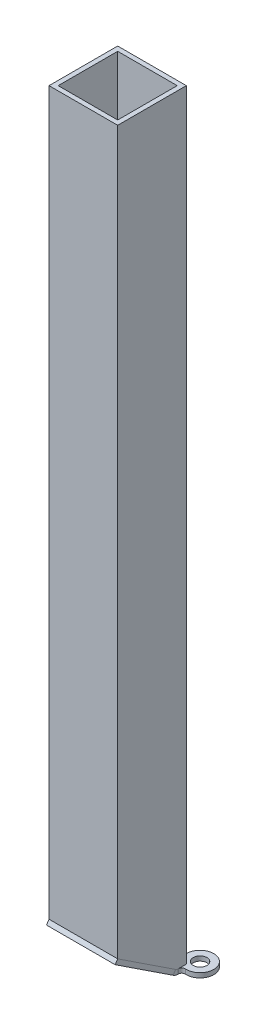
ISO-10303-21;
HEADER;
FILE_DESCRIPTION(('STEP AP214'),'2;1');
FILE_NAME('part.step','',(''),(''),'','','');
FILE_SCHEMA(('AUTOMOTIVE_DESIGN { 1 0 10303 214 1 1 1 1 }'));
ENDSEC;
DATA;
#1=APPLICATION_CONTEXT('core data for automotive mechanical design processes');
#2=APPLICATION_PROTOCOL_DEFINITION('international standard','automotive_design',2000,#1);
#3=PRODUCT_CONTEXT('',#1,'mechanical');
#4=PRODUCT('Part','Part','',(#3));
#5=PRODUCT_RELATED_PRODUCT_CATEGORY('part','',(#4));
#6=PRODUCT_DEFINITION_FORMATION('','',#4);
#7=PRODUCT_DEFINITION_CONTEXT('part definition',#1,'design');
#8=PRODUCT_DEFINITION('design','',#6,#7);
#9=PRODUCT_DEFINITION_SHAPE('','',#8);
#10=(LENGTH_UNIT() NAMED_UNIT(*) SI_UNIT(.MILLI.,.METRE.));
#11=(NAMED_UNIT(*) PLANE_ANGLE_UNIT() SI_UNIT($,.RADIAN.));
#12=(NAMED_UNIT(*) SI_UNIT($,.STERADIAN.) SOLID_ANGLE_UNIT());
#13=UNCERTAINTY_MEASURE_WITH_UNIT(LENGTH_MEASURE(1.E-05),#10,'distance_accuracy_value','');
#14=(GEOMETRIC_REPRESENTATION_CONTEXT(3) GLOBAL_UNCERTAINTY_ASSIGNED_CONTEXT((#13)) GLOBAL_UNIT_ASSIGNED_CONTEXT((#10,
#11,#12)) REPRESENTATION_CONTEXT('',''));
#15=CARTESIAN_POINT('',(0.,0.,0.));
#16=DIRECTION('',(0.,0.,1.));
#17=DIRECTION('',(1.,0.,0.));
#18=AXIS2_PLACEMENT_3D('',#15,#16,#17);
#19=CARTESIAN_POINT('',(1005.,-334.43981096134,-434.283231707318));
#20=DIRECTION('',(0.,0.,-1.));
#21=DIRECTION('',(1.,0.,0.));
#22=AXIS2_PLACEMENT_3D('',#19,#20,#21);
#23=PLANE('',#22);
#24=DIRECTION('',(1.,0.,0.));
#25=VECTOR('',#24,1.);
#26=CARTESIAN_POINT('',(1005.,-332.43981096134,-434.283231707318));
#27=LINE('',#26,#25);
#28=CARTESIAN_POINT('',(1011.5,-332.43981096134,-434.283231707318));
#29=VERTEX_POINT('',#28);
#30=CARTESIAN_POINT('',(1028.5,-332.43981096134,-434.283231707318));
#31=VERTEX_POINT('',#30);
#32=EDGE_CURVE('E133',#29,#31,#27,.T.);
#33=ORIENTED_EDGE('',*,*,#32,.T.);
#34=DIRECTION('',(0.,-1.,0.));
#35=VECTOR('',#34,1.);
#36=CARTESIAN_POINT('',(1028.5,-332.43981096134,-434.283231707318));
#37=LINE('',#36,#35);
#38=CARTESIAN_POINT('',(1028.5,-334.43981096134,-434.283231707318));
#39=VERTEX_POINT('',#38);
#40=EDGE_CURVE('E247',#31,#39,#37,.T.);
#41=ORIENTED_EDGE('',*,*,#40,.T.);
#42=DIRECTION('',(1.,0.,0.));
#43=VECTOR('',#42,1.);
#44=CARTESIAN_POINT('',(1005.,-334.43981096134,-434.283231707318));
#45=LINE('',#44,#43);
#46=CARTESIAN_POINT('',(1011.5,-334.43981096134,-434.283231707318));
#47=VERTEX_POINT('',#46);
#48=EDGE_CURVE('E168',#47,#39,#45,.T.);
#49=ORIENTED_EDGE('',*,*,#48,.F.);
#50=DIRECTION('',(0.,-1.,0.));
#51=VECTOR('',#50,1.);
#52=CARTESIAN_POINT('',(1011.5,-332.43981096134,-434.283231707318));
#53=LINE('',#52,#51);
#54=EDGE_CURVE('E208',#29,#47,#53,.T.);
#55=ORIENTED_EDGE('',*,*,#54,.F.);
#56=EDGE_LOOP('',(#33,#41,#49,#55));
#57=FACE_BOUND('',#56,.T.);
#58=ADVANCED_FACE('F51',(#57),#23,.T.);
#59=CARTESIAN_POINT('',(1035.,-334.43981096134,-430.113764924496));
#60=DIRECTION('',(-1.,0.,0.));
#61=DIRECTION('',(0.,0.,-1.));
#62=AXIS2_PLACEMENT_3D('',#59,#60,#61);
#63=PLANE('',#62);
#64=DIRECTION('',(0.,0.,-1.));
#65=VECTOR('',#64,1.);
#66=CARTESIAN_POINT('',(1035.,-332.43981096134,-430.113764924496));
#67=LINE('',#66,#65);
#68=CARTESIAN_POINT('',(1035.,-332.43981096134,-430.712849211409));
#69=VERTEX_POINT('',#68);
#70=CARTESIAN_POINT('',(1035.,-332.43981096134,-430.79991693377));
#71=VERTEX_POINT('',#70);
#72=EDGE_CURVE('E101',#69,#71,#67,.T.);
#73=ORIENTED_EDGE('',*,*,#72,.F.);
#74=DIRECTION('',(0.,-1.,0.));
#75=VECTOR('',#74,1.);
#76=CARTESIAN_POINT('',(1035.,-334.43981096134,-430.712849211409));
#77=LINE('',#76,#75);
#78=CARTESIAN_POINT('',(1035.,-334.43981096134,-430.712849211409));
#79=VERTEX_POINT('',#78);
#80=EDGE_CURVE('E12',#69,#79,#77,.T.);
#81=ORIENTED_EDGE('',*,*,#80,.T.);
#82=DIRECTION('',(0.,0.,-1.));
#83=VECTOR('',#82,1.);
#84=CARTESIAN_POINT('',(1035.,-334.43981096134,-430.113764924496));
#85=LINE('',#84,#83);
#86=CARTESIAN_POINT('',(1035.,-334.43981096134,-430.79991693377));
#87=VERTEX_POINT('',#86);
#88=EDGE_CURVE('E174',#79,#87,#85,.T.);
#89=ORIENTED_EDGE('',*,*,#88,.T.);
#90=DIRECTION('',(0.,-1.,0.));
#91=VECTOR('',#90,1.);
#92=CARTESIAN_POINT('',(1035.,-332.43981096134,-430.79991693377));
#93=LINE('',#92,#91);
#94=EDGE_CURVE('E132',#71,#87,#93,.T.);
#95=ORIENTED_EDGE('',*,*,#94,.F.);
#96=EDGE_LOOP('',(#73,#81,#89,#95));
#97=FACE_BOUND('',#96,.T.);
#98=ADVANCED_FACE('F130',(#97),#63,.F.);
#99=CARTESIAN_POINT('',(1005.,-334.43981096134,-430.113764924496));
#100=DIRECTION('',(-1.,0.,0.));
#101=DIRECTION('',(0.,0.,-1.));
#102=AXIS2_PLACEMENT_3D('',#99,#100,#101);
#103=PLANE('',#102);
#104=DIRECTION('',(0.,-1.,0.));
#105=VECTOR('',#104,1.);
#106=CARTESIAN_POINT('',(1005.,-332.43981096134,-430.79991693377));
#107=LINE('',#106,#105);
#108=CARTESIAN_POINT('',(1005.,-332.43981096134,-430.79991693377));
#109=VERTEX_POINT('',#108);
#110=CARTESIAN_POINT('',(1005.,-334.43981096134,-430.79991693377));
#111=VERTEX_POINT('',#110);
#112=EDGE_CURVE('E164',#109,#111,#107,.T.);
#113=ORIENTED_EDGE('',*,*,#112,.T.);
#114=DIRECTION('',(0.,0.,-1.));
#115=VECTOR('',#114,1.);
#116=CARTESIAN_POINT('',(1005.,-334.43981096134,-430.113764924496));
#117=LINE('',#116,#115);
#118=CARTESIAN_POINT('',(1005.,-334.43981096134,-430.712849211409));
#119=VERTEX_POINT('',#118);
#120=EDGE_CURVE('E160',#119,#111,#117,.T.);
#121=ORIENTED_EDGE('',*,*,#120,.F.);
#122=DIRECTION('',(0.,-1.,0.));
#123=VECTOR('',#122,1.);
#124=CARTESIAN_POINT('',(1005.,-334.43981096134,-430.712849211409));
#125=LINE('',#124,#123);
#126=CARTESIAN_POINT('',(1005.,-332.43981096134,-430.712849211409));
#127=VERTEX_POINT('',#126);
#128=EDGE_CURVE('E61',#127,#119,#125,.T.);
#129=ORIENTED_EDGE('',*,*,#128,.F.);
#130=DIRECTION('',(0.,0.,-1.));
#131=VECTOR('',#130,1.);
#132=CARTESIAN_POINT('',(1005.,-332.43981096134,-430.113764924496));
#133=LINE('',#132,#131);
#134=EDGE_CURVE('E104',#127,#109,#133,.T.);
#135=ORIENTED_EDGE('',*,*,#134,.T.);
#136=EDGE_LOOP('',(#113,#121,#129,#135));
#137=FACE_BOUND('',#136,.T.);
#138=ADVANCED_FACE('F161',(#137),#103,.T.);
#139=CARTESIAN_POINT('',(1005.,-330.43981096134,-430.712849211409));
#140=DIRECTION('',(1.,0.,0.));
#141=DIRECTION('',(0.,0.,1.));
#142=AXIS2_PLACEMENT_3D('',#139,#140,#141);
#143=PLANE('',#142);
#144=ORIENTED_EDGE('',*,*,#128,.T.);
#145=CARTESIAN_POINT('',(1005.,-330.43981096134,-430.712849211409));
#146=DIRECTION('',(1.,0.,0.));
#147=DIRECTION('',(0.,0.,-1.));
#148=AXIS2_PLACEMENT_3D('',#145,#146,#147);
#149=CIRCLE('',#148,4.);
#150=CARTESIAN_POINT('',(1005.,-333.781109326405,-428.513820963384));
#151=VERTEX_POINT('',#150);
#152=EDGE_CURVE('E155',#119,#151,#149,.F.);
#153=ORIENTED_EDGE('',*,*,#152,.T.);
#154=DIRECTION('',(0.,-0.835324591266377,0.549757062006174));
#155=VECTOR('',#154,1.);
#156=CARTESIAN_POINT('',(1005.,-333.781109326405,-428.513820963384));
#157=LINE('',#156,#155);
#158=CARTESIAN_POINT('',(1005.,-332.110460143872,-429.613335087396));
#159=VERTEX_POINT('',#158);
#160=EDGE_CURVE('E146',#159,#151,#157,.T.);
#161=ORIENTED_EDGE('',*,*,#160,.F.);
#162=CARTESIAN_POINT('',(1005.,-330.43981096134,-430.712849211409));
#163=DIRECTION('',(-1.,0.,0.));
#164=DIRECTION('',(0.,0.,1.));
#165=AXIS2_PLACEMENT_3D('',#162,#163,#164);
#166=CIRCLE('',#165,2.);
#167=EDGE_CURVE('E120',#127,#159,#166,.T.);
#168=ORIENTED_EDGE('',*,*,#167,.F.);
#169=EDGE_LOOP('',(#144,#153,#161,#168));
#170=FACE_BOUND('',#169,.T.);
#171=ADVANCED_FACE('F153',(#170),#143,.F.);
#172=CARTESIAN_POINT('',(1005.,-334.110460143872,-429.014250800484));
#173=DIRECTION('',(-1.,0.,0.));
#174=DIRECTION('',(0.,-0.549757062006174,-0.835324591266377));
#175=AXIS2_PLACEMENT_3D('',#172,#173,#174);
#176=PLANE('',#175);
#177=ORIENTED_EDGE('',*,*,#160,.T.);
#178=DIRECTION('',(0.,-0.549757062006174,-0.835324591266377));
#179=VECTOR('',#178,1.);
#180=CARTESIAN_POINT('',(1005.,-334.110460143872,-429.014250800484));
#181=LINE('',#180,#179);
#182=CARTESIAN_POINT('',(1005.,-317.110460143872,-403.183717583306));
#183=VERTEX_POINT('',#182);
#184=EDGE_CURVE('E171',#183,#151,#181,.T.);
#185=ORIENTED_EDGE('',*,*,#184,.F.);
#186=DIRECTION('',(0.,-0.835324591266377,0.549757062006174));
#187=VECTOR('',#186,1.);
#188=CARTESIAN_POINT('',(1005.,-317.110460143872,-403.183717583306));
#189=LINE('',#188,#187);
#190=CARTESIAN_POINT('',(1005.,-315.43981096134,-404.283231707318));
#191=VERTEX_POINT('',#190);
#192=EDGE_CURVE('E143',#191,#183,#189,.T.);
#193=ORIENTED_EDGE('',*,*,#192,.F.);
#194=DIRECTION('',(0.,-0.549757062006174,-0.835324591266377));
#195=VECTOR('',#194,1.);
#196=CARTESIAN_POINT('',(1005.,-332.43981096134,-430.113764924496));
#197=LINE('',#196,#195);
#198=EDGE_CURVE('E191',#191,#159,#197,.T.);
#199=ORIENTED_EDGE('',*,*,#198,.T.);
#200=EDGE_LOOP('',(#177,#185,#193,#199));
#201=FACE_BOUND('',#200,.T.);
#202=ADVANCED_FACE('F345',(#201),#176,.T.);
#203=CARTESIAN_POINT('',(1005.,-317.110460143872,-403.183717583306));
#204=DIRECTION('',(0.,-0.549757062006174,-0.835324591266377));
#205=DIRECTION('',(1.,0.,0.));
#206=AXIS2_PLACEMENT_3D('',#203,#204,#205);
#207=PLANE('',#206);
#208=ORIENTED_EDGE('',*,*,#192,.T.);
#209=DIRECTION('',(1.,0.,0.));
#210=VECTOR('',#209,1.);
#211=CARTESIAN_POINT('',(1005.,-317.110460143872,-403.183717583306));
#212=LINE('',#211,#210);
#213=CARTESIAN_POINT('',(1035.,-317.110460143872,-403.183717583306));
#214=VERTEX_POINT('',#213);
#215=EDGE_CURVE('E179',#183,#214,#212,.T.);
#216=ORIENTED_EDGE('',*,*,#215,.T.);
#217=DIRECTION('',(0.,-0.835324591266377,0.549757062006174));
#218=VECTOR('',#217,1.);
#219=CARTESIAN_POINT('',(1035.,-317.110460143872,-403.183717583306));
#220=LINE('',#219,#218);
#221=CARTESIAN_POINT('',(1035.,-315.43981096134,-404.283231707318));
#222=VERTEX_POINT('',#221);
#223=EDGE_CURVE('E140',#222,#214,#220,.T.);
#224=ORIENTED_EDGE('',*,*,#223,.F.);
#225=DIRECTION('',(1.,0.,0.));
#226=VECTOR('',#225,1.);
#227=CARTESIAN_POINT('',(1005.,-315.43981096134,-404.283231707318));
#228=LINE('',#227,#226);
#229=EDGE_CURVE('E110',#191,#222,#228,.T.);
#230=ORIENTED_EDGE('',*,*,#229,.F.);
#231=EDGE_LOOP('',(#208,#216,#224,#230));
#232=FACE_BOUND('',#231,.T.);
#233=ADVANCED_FACE('F348',(#232),#207,.F.);
#234=CARTESIAN_POINT('',(1035.,-334.110460143872,-429.014250800484));
#235=DIRECTION('',(-1.,0.,0.));
#236=DIRECTION('',(0.,-0.549757062006174,-0.835324591266377));
#237=AXIS2_PLACEMENT_3D('',#234,#235,#236);
#238=PLANE('',#237);
#239=ORIENTED_EDGE('',*,*,#223,.T.);
#240=DIRECTION('',(0.,-0.549757062006174,-0.835324591266377));
#241=VECTOR('',#240,1.);
#242=CARTESIAN_POINT('',(1035.,-334.110460143872,-429.014250800484));
#243=LINE('',#242,#241);
#244=CARTESIAN_POINT('',(1035.,-333.781109326405,-428.513820963384));
#245=VERTEX_POINT('',#244);
#246=EDGE_CURVE('E167',#214,#245,#243,.T.);
#247=ORIENTED_EDGE('',*,*,#246,.T.);
#248=DIRECTION('',(0.,-0.835324591266377,0.549757062006173));
#249=VECTOR('',#248,1.);
#250=CARTESIAN_POINT('',(1035.,-333.781109326405,-428.513820963384));
#251=LINE('',#250,#249);
#252=CARTESIAN_POINT('',(1035.,-332.110460143873,-429.613335087396));
#253=VERTEX_POINT('',#252);
#254=EDGE_CURVE('E55',#253,#245,#251,.T.);
#255=ORIENTED_EDGE('',*,*,#254,.F.);
#256=DIRECTION('',(0.,-0.549757062006174,-0.835324591266377));
#257=VECTOR('',#256,1.);
#258=CARTESIAN_POINT('',(1035.,-332.43981096134,-430.113764924496));
#259=LINE('',#258,#257);
#260=EDGE_CURVE('E189',#222,#253,#259,.T.);
#261=ORIENTED_EDGE('',*,*,#260,.F.);
#262=EDGE_LOOP('',(#239,#247,#255,#261));
#263=FACE_BOUND('',#262,.T.);
#264=ADVANCED_FACE('F352',(#263),#238,.F.);
#265=CARTESIAN_POINT('',(1035.,-330.43981096134,-430.712849211409));
#266=DIRECTION('',(-1.,0.,0.));
#267=DIRECTION('',(0.,0.,-1.));
#268=AXIS2_PLACEMENT_3D('',#265,#266,#267);
#269=PLANE('',#268);
#270=CARTESIAN_POINT('',(1035.,-330.43981096134,-430.712849211409));
#271=DIRECTION('',(-1.,0.,0.));
#272=DIRECTION('',(0.,0.,1.));
#273=AXIS2_PLACEMENT_3D('',#270,#271,#272);
#274=CIRCLE('',#273,2.);
#275=EDGE_CURVE('E114',#253,#69,#274,.F.);
#276=ORIENTED_EDGE('',*,*,#275,.F.);
#277=ORIENTED_EDGE('',*,*,#254,.T.);
#278=CARTESIAN_POINT('',(1035.,-330.43981096134,-430.712849211409));
#279=DIRECTION('',(-1.,0.,0.));
#280=DIRECTION('',(0.,0.,1.));
#281=AXIS2_PLACEMENT_3D('',#278,#279,#280);
#282=CIRCLE('',#281,4.);
#283=EDGE_CURVE('E125',#245,#79,#282,.F.);
#284=ORIENTED_EDGE('',*,*,#283,.T.);
#285=ORIENTED_EDGE('',*,*,#80,.F.);
#286=EDGE_LOOP('',(#276,#277,#284,#285));
#287=FACE_BOUND('',#286,.T.);
#288=ADVANCED_FACE('F53',(#287),#269,.F.);
#289=CARTESIAN_POINT('',(1005.,-334.110460143872,-429.014250800484));
#290=DIRECTION('',(0.,0.835324591266377,-0.549757062006174));
#291=DIRECTION('',(0.,-0.549757062006174,-0.835324591266377));
#292=AXIS2_PLACEMENT_3D('',#289,#290,#291);
#293=PLANE('',#292);
#294=ORIENTED_EDGE('',*,*,#246,.F.);
#295=ORIENTED_EDGE('',*,*,#215,.F.);
#296=ORIENTED_EDGE('',*,*,#184,.T.);
#297=DIRECTION('',(1.,0.,0.));
#298=VECTOR('',#297,1.);
#299=CARTESIAN_POINT('',(1005.,-333.781109326405,-428.513820963384));
#300=LINE('',#299,#298);
#301=EDGE_CURVE('E69',#245,#151,#300,.F.);
#302=ORIENTED_EDGE('',*,*,#301,.F.);
#303=EDGE_LOOP('',(#294,#295,#296,#302));
#304=FACE_BOUND('',#303,.T.);
#305=ADVANCED_FACE('F369',(#304),#293,.F.);
#306=CARTESIAN_POINT('',(1005.,-334.43981096134,-430.113764924496));
#307=DIRECTION('',(0.,1.,0.));
#308=DIRECTION('',(0.,0.,-1.));
#309=AXIS2_PLACEMENT_3D('',#306,#307,#308);
#310=PLANE('',#309);
#311=ORIENTED_EDGE('',*,*,#48,.T.);
#312=CARTESIAN_POINT('',(1028.05942467832,-334.43981096134,-437.250704265898));
#313=DIRECTION('',(0.,1.,0.));
#314=DIRECTION('',(0.,0.,1.));
#315=AXIS2_PLACEMENT_3D('',#312,#313,#314);
#316=CIRCLE('',#315,2.99999999999996);
#317=CARTESIAN_POINT('',(1031.03961645221,-334.43981096134,-437.594880079705));
#318=VERTEX_POINT('',#317);
#319=EDGE_CURVE('E235',#318,#39,#316,.F.);
#320=ORIENTED_EDGE('',*,*,#319,.F.);
#321=CARTESIAN_POINT('',(1037.,-334.43981096134,-438.283231707318));
#322=DIRECTION('',(0.,1.,0.));
#323=DIRECTION('',(0.,0.,1.));
#324=AXIS2_PLACEMENT_3D('',#321,#322,#323);
#325=CIRCLE('',#324,6.00000000000001);
#326=CARTESIAN_POINT('',(1036.6,-334.43981096134,-432.29657988848));
#327=VERTEX_POINT('',#326);
#328=EDGE_CURVE('E232',#318,#327,#325,.F.);
#329=ORIENTED_EDGE('',*,*,#328,.T.);
#330=CARTESIAN_POINT('',(1036.5,-334.43981096134,-430.79991693377));
#331=DIRECTION('',(0.,1.,0.));
#332=DIRECTION('',(0.,0.,1.));
#333=AXIS2_PLACEMENT_3D('',#330,#331,#332);
#334=CIRCLE('',#333,1.50000000000003);
#335=EDGE_CURVE('E239',#87,#327,#334,.F.);
#336=ORIENTED_EDGE('',*,*,#335,.F.);
#337=ORIENTED_EDGE('',*,*,#88,.F.);
#338=DIRECTION('',(1.,0.,0.));
#339=VECTOR('',#338,1.);
#340=CARTESIAN_POINT('',(1005.,-334.43981096134,-430.712849211409));
#341=LINE('',#340,#339);
#342=EDGE_CURVE('E182',#119,#79,#341,.T.);
#343=ORIENTED_EDGE('',*,*,#342,.F.);
#344=ORIENTED_EDGE('',*,*,#120,.T.);
#345=CARTESIAN_POINT('',(1003.5,-334.43981096134,-430.79991693377));
#346=DIRECTION('',(0.,1.,0.));
#347=DIRECTION('',(0.,0.,1.));
#348=AXIS2_PLACEMENT_3D('',#345,#346,#347);
#349=CIRCLE('',#348,1.50000000000003);
#350=CARTESIAN_POINT('',(1003.4,-334.43981096134,-432.29657988848));
#351=VERTEX_POINT('',#350);
#352=EDGE_CURVE('E207',#111,#351,#349,.T.);
#353=ORIENTED_EDGE('',*,*,#352,.T.);
#354=CARTESIAN_POINT('',(1003.,-334.43981096134,-438.283231707318));
#355=DIRECTION('',(0.,1.,0.));
#356=DIRECTION('',(0.,0.,1.));
#357=AXIS2_PLACEMENT_3D('',#354,#355,#356);
#358=CIRCLE('',#357,6.00000000000001);
#359=CARTESIAN_POINT('',(1008.96038354779,-334.43981096134,-437.594880079705));
#360=VERTEX_POINT('',#359);
#361=EDGE_CURVE('E312',#360,#351,#358,.T.);
#362=ORIENTED_EDGE('',*,*,#361,.F.);
#363=CARTESIAN_POINT('',(1011.94057532168,-334.43981096134,-437.250704265898));
#364=DIRECTION('',(0.,1.,0.));
#365=DIRECTION('',(0.,0.,1.));
#366=AXIS2_PLACEMENT_3D('',#363,#364,#365);
#367=CIRCLE('',#366,2.99999999999996);
#368=EDGE_CURVE('E310',#360,#47,#367,.T.);
#369=ORIENTED_EDGE('',*,*,#368,.T.);
#370=EDGE_LOOP('',(#311,#320,#329,#336,#337,#343,#344,#353,#362,#369));
#371=FACE_BOUND('',#370,.T.);
#372=CARTESIAN_POINT('',(1037.,-334.43981096134,-438.283231707318));
#373=DIRECTION('',(0.,1.,0.));
#374=DIRECTION('',(0.,0.,1.));
#375=AXIS2_PLACEMENT_3D('',#372,#373,#374);
#376=CIRCLE('',#375,2.99999999999993);
#377=CARTESIAN_POINT('',(1037.,-334.43981096134,-435.283231707318));
#378=VERTEX_POINT('',#377);
#379=EDGE_CURVE('E223',#378,#378,#376,.F.);
#380=ORIENTED_EDGE('',*,*,#379,.F.);
#381=EDGE_LOOP('',(#380));
#382=FACE_BOUND('',#381,.T.);
#383=CARTESIAN_POINT('',(1003.,-334.43981096134,-438.283231707318));
#384=DIRECTION('',(0.,1.,0.));
#385=DIRECTION('',(0.,0.,1.));
#386=AXIS2_PLACEMENT_3D('',#383,#384,#385);
#387=CIRCLE('',#386,2.99999999999993);
#388=CARTESIAN_POINT('',(1003.,-334.43981096134,-435.283231707318));
#389=VERTEX_POINT('',#388);
#390=EDGE_CURVE('E314',#389,#389,#387,.T.);
#391=ORIENTED_EDGE('',*,*,#390,.T.);
#392=EDGE_LOOP('',(#391));
#393=FACE_BOUND('',#392,.T.);
#394=ADVANCED_FACE('F256',(#371,#382,#393),#310,.F.);
#395=CARTESIAN_POINT('',(1005.,-330.43981096134,-430.712849211409));
#396=DIRECTION('',(1.,0.,0.));
#397=DIRECTION('',(0.,0.,1.));
#398=AXIS2_PLACEMENT_3D('',#395,#396,#397);
#399=CYLINDRICAL_SURFACE('',#398,4.);
#400=ORIENTED_EDGE('',*,*,#152,.F.);
#401=ORIENTED_EDGE('',*,*,#342,.T.);
#402=ORIENTED_EDGE('',*,*,#283,.F.);
#403=ORIENTED_EDGE('',*,*,#301,.T.);
#404=EDGE_LOOP('',(#400,#401,#402,#403));
#405=FACE_BOUND('',#404,.T.);
#406=ADVANCED_FACE('F365',(#405),#399,.T.);
#407=CARTESIAN_POINT('',(1005.,-332.43981096134,-430.113764924496));
#408=DIRECTION('',(0.,0.835324591266377,-0.549757062006174));
#409=DIRECTION('',(0.,-0.549757062006174,-0.835324591266377));
#410=AXIS2_PLACEMENT_3D('',#407,#408,#409);
#411=PLANE('',#410);
#412=ORIENTED_EDGE('',*,*,#260,.T.);
#413=DIRECTION('',(1.,0.,0.));
#414=VECTOR('',#413,1.);
#415=CARTESIAN_POINT('',(1005.,-332.110460143873,-429.613335087396));
#416=LINE('',#415,#414);
#417=EDGE_CURVE('E109',#253,#159,#416,.F.);
#418=ORIENTED_EDGE('',*,*,#417,.T.);
#419=ORIENTED_EDGE('',*,*,#198,.F.);
#420=ORIENTED_EDGE('',*,*,#229,.T.);
#421=EDGE_LOOP('',(#412,#418,#419,#420));
#422=FACE_BOUND('',#421,.T.);
#423=ADVANCED_FACE('F362',(#422),#411,.T.);
#424=CARTESIAN_POINT('',(1005.,-332.43981096134,-430.113764924496));
#425=DIRECTION('',(0.,1.,0.));
#426=DIRECTION('',(0.,0.,-1.));
#427=AXIS2_PLACEMENT_3D('',#424,#425,#426);
#428=PLANE('',#427);
#429=CARTESIAN_POINT('',(1011.94057532168,-332.43981096134,-437.250704265898));
#430=DIRECTION('',(0.,1.,0.));
#431=DIRECTION('',(0.,0.,1.));
#432=AXIS2_PLACEMENT_3D('',#429,#430,#431);
#433=CIRCLE('',#432,2.99999999999996);
#434=CARTESIAN_POINT('',(1008.96038354779,-332.43981096134,-437.594880079705));
#435=VERTEX_POINT('',#434);
#436=EDGE_CURVE('E293',#435,#29,#433,.T.);
#437=ORIENTED_EDGE('',*,*,#436,.F.);
#438=CARTESIAN_POINT('',(1003.,-332.43981096134,-438.283231707318));
#439=DIRECTION('',(0.,1.,0.));
#440=DIRECTION('',(0.,0.,1.));
#441=AXIS2_PLACEMENT_3D('',#438,#439,#440);
#442=CIRCLE('',#441,6.00000000000001);
#443=CARTESIAN_POINT('',(1003.4,-332.43981096134,-432.29657988848));
#444=VERTEX_POINT('',#443);
#445=EDGE_CURVE('E215',#435,#444,#442,.T.);
#446=ORIENTED_EDGE('',*,*,#445,.T.);
#447=CARTESIAN_POINT('',(1003.5,-332.43981096134,-430.79991693377));
#448=DIRECTION('',(0.,1.,0.));
#449=DIRECTION('',(0.,0.,1.));
#450=AXIS2_PLACEMENT_3D('',#447,#448,#449);
#451=CIRCLE('',#450,1.50000000000003);
#452=EDGE_CURVE('E205',#109,#444,#451,.T.);
#453=ORIENTED_EDGE('',*,*,#452,.F.);
#454=ORIENTED_EDGE('',*,*,#134,.F.);
#455=DIRECTION('',(1.,0.,0.));
#456=VECTOR('',#455,1.);
#457=CARTESIAN_POINT('',(1005.,-332.43981096134,-430.712849211409));
#458=LINE('',#457,#456);
#459=EDGE_CURVE('E93',#127,#69,#458,.T.);
#460=ORIENTED_EDGE('',*,*,#459,.T.);
#461=ORIENTED_EDGE('',*,*,#72,.T.);
#462=CARTESIAN_POINT('',(1036.5,-332.43981096134,-430.79991693377));
#463=DIRECTION('',(0.,1.,0.));
#464=DIRECTION('',(0.,0.,1.));
#465=AXIS2_PLACEMENT_3D('',#462,#463,#464);
#466=CIRCLE('',#465,1.50000000000003);
#467=CARTESIAN_POINT('',(1036.6,-332.43981096134,-432.29657988848));
#468=VERTEX_POINT('',#467);
#469=EDGE_CURVE('E226',#71,#468,#466,.F.);
#470=ORIENTED_EDGE('',*,*,#469,.T.);
#471=CARTESIAN_POINT('',(1037.,-332.43981096134,-438.283231707318));
#472=DIRECTION('',(0.,1.,0.));
#473=DIRECTION('',(0.,0.,1.));
#474=AXIS2_PLACEMENT_3D('',#471,#472,#473);
#475=CIRCLE('',#474,6.00000000000001);
#476=CARTESIAN_POINT('',(1031.03961645221,-332.43981096134,-437.594880079705));
#477=VERTEX_POINT('',#476);
#478=EDGE_CURVE('E219',#477,#468,#475,.F.);
#479=ORIENTED_EDGE('',*,*,#478,.F.);
#480=CARTESIAN_POINT('',(1028.05942467832,-332.43981096134,-437.250704265898));
#481=DIRECTION('',(0.,1.,0.));
#482=DIRECTION('',(0.,0.,1.));
#483=AXIS2_PLACEMENT_3D('',#480,#481,#482);
#484=CIRCLE('',#483,2.99999999999996);
#485=EDGE_CURVE('E222',#477,#31,#484,.F.);
#486=ORIENTED_EDGE('',*,*,#485,.T.);
#487=ORIENTED_EDGE('',*,*,#32,.F.);
#488=EDGE_LOOP('',(#437,#446,#453,#454,#460,#461,#470,#479,#486,#487));
#489=FACE_BOUND('',#488,.T.);
#490=CARTESIAN_POINT('',(1037.,-332.43981096134,-438.283231707318));
#491=DIRECTION('',(0.,1.,0.));
#492=DIRECTION('',(0.,0.,1.));
#493=AXIS2_PLACEMENT_3D('',#490,#491,#492);
#494=CIRCLE('',#493,2.99999999999993);
#495=CARTESIAN_POINT('',(1037.,-332.43981096134,-435.283231707318));
#496=VERTEX_POINT('',#495);
#497=EDGE_CURVE('E228',#496,#496,#494,.F.);
#498=ORIENTED_EDGE('',*,*,#497,.T.);
#499=EDGE_LOOP('',(#498));
#500=FACE_BOUND('',#499,.T.);
#501=CARTESIAN_POINT('',(1003.,-332.43981096134,-438.283231707318));
#502=DIRECTION('',(0.,1.,0.));
#503=DIRECTION('',(0.,0.,1.));
#504=AXIS2_PLACEMENT_3D('',#501,#502,#503);
#505=CIRCLE('',#504,2.99999999999993);
#506=CARTESIAN_POINT('',(1003.,-332.43981096134,-435.283231707318));
#507=VERTEX_POINT('',#506);
#508=EDGE_CURVE('E209',#507,#507,#505,.T.);
#509=ORIENTED_EDGE('',*,*,#508,.F.);
#510=EDGE_LOOP('',(#509));
#511=FACE_BOUND('',#510,.T.);
#512=ADVANCED_FACE('F96',(#489,#500,#511),#428,.T.);
#513=CARTESIAN_POINT('',(1005.,-330.43981096134,-430.712849211409));
#514=DIRECTION('',(1.,0.,0.));
#515=DIRECTION('',(0.,0.,1.));
#516=AXIS2_PLACEMENT_3D('',#513,#514,#515);
#517=CYLINDRICAL_SURFACE('',#516,2.);
#518=ORIENTED_EDGE('',*,*,#167,.T.);
#519=ORIENTED_EDGE('',*,*,#417,.F.);
#520=ORIENTED_EDGE('',*,*,#275,.T.);
#521=ORIENTED_EDGE('',*,*,#459,.F.);
#522=EDGE_LOOP('',(#518,#519,#520,#521));
#523=FACE_BOUND('',#522,.T.);
#524=ADVANCED_FACE('F116',(#523),#517,.F.);
#525=CARTESIAN_POINT('',(1037.,-332.43981096134,-438.283231707318));
#526=DIRECTION('',(0.,-1.,0.));
#527=DIRECTION('',(0.,0.,1.));
#528=AXIS2_PLACEMENT_3D('',#525,#526,#527);
#529=CYLINDRICAL_SURFACE('',#528,6.00000000000001);
#530=ORIENTED_EDGE('',*,*,#328,.F.);
#531=DIRECTION('',(0.,-1.,0.));
#532=VECTOR('',#531,1.);
#533=CARTESIAN_POINT('',(1031.03961645221,-332.43981096134,-437.594880079705));
#534=LINE('',#533,#532);
#535=EDGE_CURVE('E231',#477,#318,#534,.T.);
#536=ORIENTED_EDGE('',*,*,#535,.F.);
#537=ORIENTED_EDGE('',*,*,#478,.T.);
#538=DIRECTION('',(0.,-1.,0.));
#539=VECTOR('',#538,1.);
#540=CARTESIAN_POINT('',(1036.6,-332.43981096134,-432.29657988848));
#541=LINE('',#540,#539);
#542=EDGE_CURVE('E121',#468,#327,#541,.T.);
#543=ORIENTED_EDGE('',*,*,#542,.T.);
#544=EDGE_LOOP('',(#530,#536,#537,#543));
#545=FACE_BOUND('',#544,.T.);
#546=ADVANCED_FACE('F359',(#545),#529,.T.);
#547=CARTESIAN_POINT('',(1036.5,-332.43981096134,-430.79991693377));
#548=DIRECTION('',(0.,-1.,0.));
#549=DIRECTION('',(0.,0.,1.));
#550=AXIS2_PLACEMENT_3D('',#547,#548,#549);
#551=CYLINDRICAL_SURFACE('',#550,1.50000000000003);
#552=ORIENTED_EDGE('',*,*,#335,.T.);
#553=ORIENTED_EDGE('',*,*,#542,.F.);
#554=ORIENTED_EDGE('',*,*,#469,.F.);
#555=ORIENTED_EDGE('',*,*,#94,.T.);
#556=EDGE_LOOP('',(#552,#553,#554,#555));
#557=FACE_BOUND('',#556,.T.);
#558=ADVANCED_FACE('F377',(#557),#551,.F.);
#559=CARTESIAN_POINT('',(1028.05942467832,-332.43981096134,-437.250704265898));
#560=DIRECTION('',(0.,-1.,0.));
#561=DIRECTION('',(0.,0.,1.));
#562=AXIS2_PLACEMENT_3D('',#559,#560,#561);
#563=CYLINDRICAL_SURFACE('',#562,2.99999999999996);
#564=ORIENTED_EDGE('',*,*,#319,.T.);
#565=ORIENTED_EDGE('',*,*,#40,.F.);
#566=ORIENTED_EDGE('',*,*,#485,.F.);
#567=ORIENTED_EDGE('',*,*,#535,.T.);
#568=EDGE_LOOP('',(#564,#565,#566,#567));
#569=FACE_BOUND('',#568,.T.);
#570=ADVANCED_FACE('F306',(#569),#563,.F.);
#571=CARTESIAN_POINT('',(1037.,-332.43981096134,-438.283231707318));
#572=DIRECTION('',(0.,-1.,0.));
#573=DIRECTION('',(0.,0.,1.));
#574=AXIS2_PLACEMENT_3D('',#571,#572,#573);
#575=CYLINDRICAL_SURFACE('',#574,2.99999999999993);
#576=ORIENTED_EDGE('',*,*,#497,.F.);
#577=EDGE_LOOP('',(#576));
#578=FACE_BOUND('',#577,.T.);
#579=ORIENTED_EDGE('',*,*,#379,.T.);
#580=EDGE_LOOP('',(#579));
#581=FACE_BOUND('',#580,.T.);
#582=ADVANCED_FACE('F332',(#578,#581),#575,.F.);
#583=CARTESIAN_POINT('',(1003.5,-332.43981096134,-430.79991693377));
#584=DIRECTION('',(0.,-1.,0.));
#585=DIRECTION('',(0.,0.,1.));
#586=AXIS2_PLACEMENT_3D('',#583,#584,#585);
#587=CYLINDRICAL_SURFACE('',#586,1.50000000000003);
#588=ORIENTED_EDGE('',*,*,#352,.F.);
#589=ORIENTED_EDGE('',*,*,#112,.F.);
#590=ORIENTED_EDGE('',*,*,#452,.T.);
#591=DIRECTION('',(0.,-1.,0.));
#592=VECTOR('',#591,1.);
#593=CARTESIAN_POINT('',(1003.4,-332.43981096134,-432.29657988848));
#594=LINE('',#593,#592);
#595=EDGE_CURVE('E236',#444,#351,#594,.T.);
#596=ORIENTED_EDGE('',*,*,#595,.T.);
#597=EDGE_LOOP('',(#588,#589,#590,#596));
#598=FACE_BOUND('',#597,.T.);
#599=ADVANCED_FACE('F202',(#598),#587,.F.);
#600=CARTESIAN_POINT('',(1003.,-332.43981096134,-438.283231707318));
#601=DIRECTION('',(0.,-1.,0.));
#602=DIRECTION('',(0.,0.,1.));
#603=AXIS2_PLACEMENT_3D('',#600,#601,#602);
#604=CYLINDRICAL_SURFACE('',#603,6.00000000000001);
#605=ORIENTED_EDGE('',*,*,#361,.T.);
#606=ORIENTED_EDGE('',*,*,#595,.F.);
#607=ORIENTED_EDGE('',*,*,#445,.F.);
#608=DIRECTION('',(0.,-1.,0.));
#609=VECTOR('',#608,1.);
#610=CARTESIAN_POINT('',(1008.96038354779,-332.43981096134,-437.594880079705));
#611=LINE('',#610,#609);
#612=EDGE_CURVE('E212',#435,#360,#611,.T.);
#613=ORIENTED_EDGE('',*,*,#612,.T.);
#614=EDGE_LOOP('',(#605,#606,#607,#613));
#615=FACE_BOUND('',#614,.T.);
#616=ADVANCED_FACE('F321',(#615),#604,.T.);
#617=CARTESIAN_POINT('',(1011.94057532168,-332.43981096134,-437.250704265898));
#618=DIRECTION('',(0.,-1.,0.));
#619=DIRECTION('',(0.,0.,1.));
#620=AXIS2_PLACEMENT_3D('',#617,#618,#619);
#621=CYLINDRICAL_SURFACE('',#620,2.99999999999996);
#622=ORIENTED_EDGE('',*,*,#368,.F.);
#623=ORIENTED_EDGE('',*,*,#612,.F.);
#624=ORIENTED_EDGE('',*,*,#436,.T.);
#625=ORIENTED_EDGE('',*,*,#54,.T.);
#626=EDGE_LOOP('',(#622,#623,#624,#625));
#627=FACE_BOUND('',#626,.T.);
#628=ADVANCED_FACE('F296',(#627),#621,.F.);
#629=CARTESIAN_POINT('',(1003.,-332.43981096134,-438.283231707318));
#630=DIRECTION('',(0.,-1.,0.));
#631=DIRECTION('',(0.,0.,1.));
#632=AXIS2_PLACEMENT_3D('',#629,#630,#631);
#633=CYLINDRICAL_SURFACE('',#632,2.99999999999993);
#634=ORIENTED_EDGE('',*,*,#508,.T.);
#635=EDGE_LOOP('',(#634));
#636=FACE_BOUND('',#635,.T.);
#637=ORIENTED_EDGE('',*,*,#390,.F.);
#638=EDGE_LOOP('',(#637));
#639=FACE_BOUND('',#638,.T.);
#640=ADVANCED_FACE('F330',(#636,#639),#633,.F.);
#641=CLOSED_SHELL('',(#58,#98,#138,#171,#202,#233,#264,#288,#305,#394,#406,#423,#512,#524,#546,
#558,#570,#582,#599,#616,#628,#640));
#642=MANIFOLD_SOLID_BREP('B2',#641);
#643=CARTESIAN_POINT('',(1005.,-332.43981096134,-404.283231707318));
#644=DIRECTION('',(1.,0.,0.));
#645=DIRECTION('',(0.,0.,1.));
#646=AXIS2_PLACEMENT_3D('',#643,#644,#645);
#647=PLANE('',#646);
#648=DIRECTION('',(0.,0.549757062006172,0.835324591266378));
#649=VECTOR('',#648,1.);
#650=CARTESIAN_POINT('',(1005.,-332.43981096134,-430.113764924496));
#651=LINE('',#650,#649);
#652=CARTESIAN_POINT('',(1005.,-332.43981096134,-430.113764924496));
#653=VERTEX_POINT('',#652);
#654=CARTESIAN_POINT('',(1005.,-315.43981096134,-404.283231707318));
#655=VERTEX_POINT('',#654);
#656=EDGE_CURVE('E688',#653,#655,#651,.T.);
#657=ORIENTED_EDGE('',*,*,#656,.T.);
#658=DIRECTION('',(0.,1.,0.));
#659=VECTOR('',#658,1.);
#660=CARTESIAN_POINT('',(1005.,-332.43981096134,-404.283231707318));
#661=LINE('',#660,#659);
#662=CARTESIAN_POINT('',(1005.,0.,-404.283231707318));
#663=VERTEX_POINT('',#662);
#664=EDGE_CURVE('E599',#655,#663,#661,.T.);
#665=ORIENTED_EDGE('',*,*,#664,.T.);
#666=DIRECTION('',(0.,0.,1.));
#667=VECTOR('',#666,1.);
#668=CARTESIAN_POINT('',(1005.,0.,-404.283231707318));
#669=LINE('',#668,#667);
#670=CARTESIAN_POINT('',(1005.,0.,-434.283231707318));
#671=VERTEX_POINT('',#670);
#672=EDGE_CURVE('E723',#671,#663,#669,.T.);
#673=ORIENTED_EDGE('',*,*,#672,.F.);
#674=DIRECTION('',(0.,1.,0.));
#675=VECTOR('',#674,1.);
#676=CARTESIAN_POINT('',(1005.,-332.43981096134,-434.283231707318));
#677=LINE('',#676,#675);
#678=CARTESIAN_POINT('',(1005.,-332.43981096134,-434.283231707318));
#679=VERTEX_POINT('',#678);
#680=EDGE_CURVE('E690',#679,#671,#677,.T.);
#681=ORIENTED_EDGE('',*,*,#680,.F.);
#682=DIRECTION('',(0.,0.,1.));
#683=VECTOR('',#682,1.);
#684=CARTESIAN_POINT('',(1005.,-332.43981096134,-404.283231707318));
#685=LINE('',#684,#683);
#686=EDGE_CURVE('E676',#679,#653,#685,.T.);
#687=ORIENTED_EDGE('',*,*,#686,.T.);
#688=EDGE_LOOP('',(#657,#665,#673,#681,#687));
#689=FACE_BOUND('',#688,.T.);
#690=ADVANCED_FACE('F591',(#689),#647,.F.);
#691=CARTESIAN_POINT('',(1035.,-332.43981096134,-404.283231707318));
#692=DIRECTION('',(0.,0.,-1.));
#693=DIRECTION('',(1.,0.,0.));
#694=AXIS2_PLACEMENT_3D('',#691,#692,#693);
#695=PLANE('',#694);
#696=DIRECTION('',(1.,0.,0.));
#697=VECTOR('',#696,1.);
#698=CARTESIAN_POINT('',(1005.,-315.43981096134,-404.283231707318));
#699=LINE('',#698,#697);
#700=CARTESIAN_POINT('',(1035.,-315.43981096134,-404.283231707318));
#701=VERTEX_POINT('',#700);
#702=EDGE_CURVE('E683',#655,#701,#699,.T.);
#703=ORIENTED_EDGE('',*,*,#702,.T.);
#704=DIRECTION('',(0.,1.,0.));
#705=VECTOR('',#704,1.);
#706=CARTESIAN_POINT('',(1035.,-332.43981096134,-404.283231707318));
#707=LINE('',#706,#705);
#708=CARTESIAN_POINT('',(1035.,0.,-404.283231707318));
#709=VERTEX_POINT('',#708);
#710=EDGE_CURVE('E736',#701,#709,#707,.T.);
#711=ORIENTED_EDGE('',*,*,#710,.T.);
#712=DIRECTION('',(1.,0.,0.));
#713=VECTOR('',#712,1.);
#714=CARTESIAN_POINT('',(1035.,0.,-404.283231707318));
#715=LINE('',#714,#713);
#716=EDGE_CURVE('E725',#663,#709,#715,.T.);
#717=ORIENTED_EDGE('',*,*,#716,.F.);
#718=ORIENTED_EDGE('',*,*,#664,.F.);
#719=EDGE_LOOP('',(#703,#711,#717,#718));
#720=FACE_BOUND('',#719,.T.);
#721=ADVANCED_FACE('F776',(#720),#695,.F.);
#722=CARTESIAN_POINT('',(1035.,-332.43981096134,-404.283231707318));
#723=DIRECTION('',(-1.,0.,0.));
#724=DIRECTION('',(0.,0.,-1.));
#725=AXIS2_PLACEMENT_3D('',#722,#723,#724);
#726=PLANE('',#725);
#727=DIRECTION('',(0.,0.549757062006172,0.835324591266378));
#728=VECTOR('',#727,1.);
#729=CARTESIAN_POINT('',(1035.,-332.43981096134,-430.113764924496));
#730=LINE('',#729,#728);
#731=CARTESIAN_POINT('',(1035.,-332.43981096134,-430.113764924496));
#732=VERTEX_POINT('',#731);
#733=EDGE_CURVE('E696',#732,#701,#730,.T.);
#734=ORIENTED_EDGE('',*,*,#733,.F.);
#735=DIRECTION('',(0.,0.,-1.));
#736=VECTOR('',#735,1.);
#737=CARTESIAN_POINT('',(1035.,-332.43981096134,-404.283231707318));
#738=LINE('',#737,#736);
#739=CARTESIAN_POINT('',(1035.,-332.43981096134,-434.283231707318));
#740=VERTEX_POINT('',#739);
#741=EDGE_CURVE('E691',#732,#740,#738,.T.);
#742=ORIENTED_EDGE('',*,*,#741,.T.);
#743=DIRECTION('',(0.,1.,0.));
#744=VECTOR('',#743,1.);
#745=CARTESIAN_POINT('',(1035.,-332.43981096134,-434.283231707318));
#746=LINE('',#745,#744);
#747=CARTESIAN_POINT('',(1035.,0.,-434.283231707318));
#748=VERTEX_POINT('',#747);
#749=EDGE_CURVE('E732',#740,#748,#746,.T.);
#750=ORIENTED_EDGE('',*,*,#749,.T.);
#751=DIRECTION('',(0.,0.,-1.));
#752=VECTOR('',#751,1.);
#753=CARTESIAN_POINT('',(1035.,0.,-404.283231707318));
#754=LINE('',#753,#752);
#755=EDGE_CURVE('E728',#709,#748,#754,.T.);
#756=ORIENTED_EDGE('',*,*,#755,.F.);
#757=ORIENTED_EDGE('',*,*,#710,.F.);
#758=EDGE_LOOP('',(#734,#742,#750,#756,#757));
#759=FACE_BOUND('',#758,.T.);
#760=ADVANCED_FACE('F781',(#759),#726,.F.);
#761=CARTESIAN_POINT('',(1033.,-332.43981096134,-406.283231707318));
#762=DIRECTION('',(-1.,0.,0.));
#763=DIRECTION('',(0.,0.,-1.));
#764=AXIS2_PLACEMENT_3D('',#761,#762,#763);
#765=PLANE('',#764);
#766=DIRECTION('',(0.,1.,0.));
#767=VECTOR('',#766,1.);
#768=CARTESIAN_POINT('',(1033.,-332.43981096134,-406.283231707318));
#769=LINE('',#768,#767);
#770=CARTESIAN_POINT('',(1033.,-316.756082666385,-406.283231707318));
#771=VERTEX_POINT('',#770);
#772=CARTESIAN_POINT('',(1033.,0.,-406.283231707318));
#773=VERTEX_POINT('',#772);
#774=EDGE_CURVE('E733',#771,#773,#769,.T.);
#775=ORIENTED_EDGE('',*,*,#774,.T.);
#776=DIRECTION('',(0.,0.,-1.));
#777=VECTOR('',#776,1.);
#778=CARTESIAN_POINT('',(1033.,0.,-406.283231707318));
#779=LINE('',#778,#777);
#780=CARTESIAN_POINT('',(1033.,0.,-432.283231707318));
#781=VERTEX_POINT('',#780);
#782=EDGE_CURVE('E706',#773,#781,#779,.T.);
#783=ORIENTED_EDGE('',*,*,#782,.T.);
#784=DIRECTION('',(0.,1.,0.));
#785=VECTOR('',#784,1.);
#786=CARTESIAN_POINT('',(1033.,-332.43981096134,-432.283231707318));
#787=LINE('',#786,#785);
#788=CARTESIAN_POINT('',(1033.,-332.43981096134,-432.283231707318));
#789=VERTEX_POINT('',#788);
#790=EDGE_CURVE('E714',#789,#781,#787,.T.);
#791=ORIENTED_EDGE('',*,*,#790,.F.);
#792=DIRECTION('',(0.,0.,-1.));
#793=VECTOR('',#792,1.);
#794=CARTESIAN_POINT('',(1033.,-332.43981096134,-406.283231707318));
#795=LINE('',#794,#793);
#796=CARTESIAN_POINT('',(1033.,-332.43981096134,-430.113764924496));
#797=VERTEX_POINT('',#796);
#798=EDGE_CURVE('E707',#797,#789,#795,.T.);
#799=ORIENTED_EDGE('',*,*,#798,.F.);
#800=DIRECTION('',(0.,-0.549757062006172,-0.835324591266378));
#801=VECTOR('',#800,1.);
#802=CARTESIAN_POINT('',(1033.,-321.496220210408,-413.485601135841));
#803=LINE('',#802,#801);
#804=EDGE_CURVE('E704',#771,#797,#803,.T.);
#805=ORIENTED_EDGE('',*,*,#804,.F.);
#806=EDGE_LOOP('',(#775,#783,#791,#799,#805));
#807=FACE_BOUND('',#806,.T.);
#808=ADVANCED_FACE('F593',(#807),#765,.T.);
#809=CARTESIAN_POINT('',(1007.,-332.43981096134,-406.283231707318));
#810=DIRECTION('',(0.,0.,-1.));
#811=DIRECTION('',(1.,0.,0.));
#812=AXIS2_PLACEMENT_3D('',#809,#810,#811);
#813=PLANE('',#812);
#814=DIRECTION('',(0.,1.,0.));
#815=VECTOR('',#814,1.);
#816=CARTESIAN_POINT('',(1007.,-332.43981096134,-406.283231707318));
#817=LINE('',#816,#815);
#818=CARTESIAN_POINT('',(1007.,-316.756082666385,-406.283231707318));
#819=VERTEX_POINT('',#818);
#820=CARTESIAN_POINT('',(1007.,0.,-406.283231707318));
#821=VERTEX_POINT('',#820);
#822=EDGE_CURVE('E745',#819,#821,#817,.T.);
#823=ORIENTED_EDGE('',*,*,#822,.T.);
#824=DIRECTION('',(1.,0.,0.));
#825=VECTOR('',#824,1.);
#826=CARTESIAN_POINT('',(1007.,0.,-406.283231707318));
#827=LINE('',#826,#825);
#828=EDGE_CURVE('E717',#821,#773,#827,.T.);
#829=ORIENTED_EDGE('',*,*,#828,.T.);
#830=ORIENTED_EDGE('',*,*,#774,.F.);
#831=DIRECTION('',(1.,0.,0.));
#832=VECTOR('',#831,1.);
#833=CARTESIAN_POINT('',(1007.,-316.756082666385,-406.283231707318));
#834=LINE('',#833,#832);
#835=EDGE_CURVE('E702',#819,#771,#834,.T.);
#836=ORIENTED_EDGE('',*,*,#835,.F.);
#837=EDGE_LOOP('',(#823,#829,#830,#836));
#838=FACE_BOUND('',#837,.T.);
#839=ADVANCED_FACE('F756',(#838),#813,.T.);
#840=CARTESIAN_POINT('',(1007.,-332.43981096134,-406.283231707318));
#841=DIRECTION('',(1.,0.,0.));
#842=DIRECTION('',(0.,0.,1.));
#843=AXIS2_PLACEMENT_3D('',#840,#841,#842);
#844=PLANE('',#843);
#845=DIRECTION('',(0.,0.,1.));
#846=VECTOR('',#845,1.);
#847=CARTESIAN_POINT('',(1007.,-332.43981096134,-406.283231707318));
#848=LINE('',#847,#846);
#849=CARTESIAN_POINT('',(1007.,-332.43981096134,-432.283231707318));
#850=VERTEX_POINT('',#849);
#851=CARTESIAN_POINT('',(1007.,-332.43981096134,-430.113764924496));
#852=VERTEX_POINT('',#851);
#853=EDGE_CURVE('E679',#850,#852,#848,.T.);
#854=ORIENTED_EDGE('',*,*,#853,.F.);
#855=DIRECTION('',(0.,1.,0.));
#856=VECTOR('',#855,1.);
#857=CARTESIAN_POINT('',(1007.,-332.43981096134,-432.283231707318));
#858=LINE('',#857,#856);
#859=CARTESIAN_POINT('',(1007.,0.,-432.283231707318));
#860=VERTEX_POINT('',#859);
#861=EDGE_CURVE('E742',#850,#860,#858,.T.);
#862=ORIENTED_EDGE('',*,*,#861,.T.);
#863=DIRECTION('',(0.,0.,1.));
#864=VECTOR('',#863,1.);
#865=CARTESIAN_POINT('',(1007.,0.,-406.283231707318));
#866=LINE('',#865,#864);
#867=EDGE_CURVE('E719',#860,#821,#866,.T.);
#868=ORIENTED_EDGE('',*,*,#867,.T.);
#869=ORIENTED_EDGE('',*,*,#822,.F.);
#870=DIRECTION('',(0.,0.549757062006172,0.835324591266378));
#871=VECTOR('',#870,1.);
#872=CARTESIAN_POINT('',(1007.,-321.496220210408,-413.485601135841));
#873=LINE('',#872,#871);
#874=EDGE_CURVE('E682',#852,#819,#873,.T.);
#875=ORIENTED_EDGE('',*,*,#874,.F.);
#876=EDGE_LOOP('',(#854,#862,#868,#869,#875));
#877=FACE_BOUND('',#876,.T.);
#878=ADVANCED_FACE('F766',(#877),#844,.T.);
#879=CARTESIAN_POINT('',(0.,-332.439810961339,85.6874510994396));
#880=DIRECTION('',(0.,-1.,0.));
#881=DIRECTION('',(0.,0.,1.));
#882=AXIS2_PLACEMENT_3D('',#879,#880,#881);
#883=PLANE('',#882);
#884=ORIENTED_EDGE('',*,*,#686,.F.);
#885=DIRECTION('',(-1.,0.,0.));
#886=VECTOR('',#885,1.);
#887=CARTESIAN_POINT('',(1035.,-332.43981096134,-434.283231707318));
#888=LINE('',#887,#886);
#889=EDGE_CURVE('E613',#740,#679,#888,.T.);
#890=ORIENTED_EDGE('',*,*,#889,.F.);
#891=ORIENTED_EDGE('',*,*,#741,.F.);
#892=DIRECTION('',(1.,0.,0.));
#893=VECTOR('',#892,1.);
#894=CARTESIAN_POINT('',(0.,-332.43981096134,-430.113764924496));
#895=LINE('',#894,#893);
#896=EDGE_CURVE('E49',#797,#732,#895,.T.);
#897=ORIENTED_EDGE('',*,*,#896,.F.);
#898=ORIENTED_EDGE('',*,*,#798,.T.);
#899=DIRECTION('',(-1.,0.,0.));
#900=VECTOR('',#899,1.);
#901=CARTESIAN_POINT('',(1007.,-332.43981096134,-432.283231707318));
#902=LINE('',#901,#900);
#903=EDGE_CURVE('E653',#789,#850,#902,.T.);
#904=ORIENTED_EDGE('',*,*,#903,.T.);
#905=ORIENTED_EDGE('',*,*,#853,.T.);
#906=DIRECTION('',(1.,0.,0.));
#907=VECTOR('',#906,1.);
#908=CARTESIAN_POINT('',(1005.,-332.43981096134,-430.113764924496));
#909=LINE('',#908,#907);
#910=EDGE_CURVE('E673',#653,#852,#909,.T.);
#911=ORIENTED_EDGE('',*,*,#910,.F.);
#912=EDGE_LOOP('',(#884,#890,#891,#897,#898,#904,#905,#911));
#913=FACE_BOUND('',#912,.T.);
#914=ADVANCED_FACE('F675',(#913),#883,.T.);
#915=CARTESIAN_POINT('',(1007.,-332.43981096134,-432.283231707318));
#916=DIRECTION('',(0.,0.,1.));
#917=DIRECTION('',(-1.,0.,0.));
#918=AXIS2_PLACEMENT_3D('',#915,#916,#917);
#919=PLANE('',#918);
#920=DIRECTION('',(-1.,0.,0.));
#921=VECTOR('',#920,1.);
#922=CARTESIAN_POINT('',(1007.,0.,-432.283231707318));
#923=LINE('',#922,#921);
#924=EDGE_CURVE('E721',#781,#860,#923,.T.);
#925=ORIENTED_EDGE('',*,*,#924,.T.);
#926=ORIENTED_EDGE('',*,*,#861,.F.);
#927=ORIENTED_EDGE('',*,*,#903,.F.);
#928=ORIENTED_EDGE('',*,*,#790,.T.);
#929=EDGE_LOOP('',(#925,#926,#927,#928));
#930=FACE_BOUND('',#929,.T.);
#931=ADVANCED_FACE('F763',(#930),#919,.T.);
#932=CARTESIAN_POINT('',(1035.,-332.43981096134,-434.283231707318));
#933=DIRECTION('',(0.,0.,1.));
#934=DIRECTION('',(-1.,0.,0.));
#935=AXIS2_PLACEMENT_3D('',#932,#933,#934);
#936=PLANE('',#935);
#937=DIRECTION('',(-1.,0.,0.));
#938=VECTOR('',#937,1.);
#939=CARTESIAN_POINT('',(1035.,0.,-434.283231707318));
#940=LINE('',#939,#938);
#941=EDGE_CURVE('E646',#748,#671,#940,.T.);
#942=ORIENTED_EDGE('',*,*,#941,.F.);
#943=ORIENTED_EDGE('',*,*,#749,.F.);
#944=ORIENTED_EDGE('',*,*,#889,.T.);
#945=ORIENTED_EDGE('',*,*,#680,.T.);
#946=EDGE_LOOP('',(#942,#943,#944,#945));
#947=FACE_BOUND('',#946,.T.);
#948=ADVANCED_FACE('F786',(#947),#936,.F.);
#949=CARTESIAN_POINT('',(0.,6.10622663543836E-13,85.6874510994396));
#950=DIRECTION('',(0.,-1.,0.));
#951=DIRECTION('',(0.,0.,1.));
#952=AXIS2_PLACEMENT_3D('',#949,#950,#951);
#953=PLANE('',#952);
#954=ORIENTED_EDGE('',*,*,#782,.F.);
#955=ORIENTED_EDGE('',*,*,#828,.F.);
#956=ORIENTED_EDGE('',*,*,#867,.F.);
#957=ORIENTED_EDGE('',*,*,#924,.F.);
#958=EDGE_LOOP('',(#954,#955,#956,#957));
#959=FACE_BOUND('',#958,.T.);
#960=ORIENTED_EDGE('',*,*,#672,.T.);
#961=ORIENTED_EDGE('',*,*,#716,.T.);
#962=ORIENTED_EDGE('',*,*,#755,.T.);
#963=ORIENTED_EDGE('',*,*,#941,.T.);
#964=EDGE_LOOP('',(#960,#961,#962,#963));
#965=FACE_BOUND('',#964,.T.);
#966=ADVANCED_FACE('F761',(#959,#965),#953,.F.);
#967=CARTESIAN_POINT('',(1005.,-332.43981096134,-430.113764924496));
#968=DIRECTION('',(0.,-0.835324591266378,0.549757062006172));
#969=DIRECTION('',(0.,0.549757062006172,0.835324591266378));
#970=AXIS2_PLACEMENT_3D('',#967,#968,#969);
#971=PLANE('',#970);
#972=ORIENTED_EDGE('',*,*,#835,.T.);
#973=ORIENTED_EDGE('',*,*,#804,.T.);
#974=ORIENTED_EDGE('',*,*,#896,.T.);
#975=ORIENTED_EDGE('',*,*,#733,.T.);
#976=ORIENTED_EDGE('',*,*,#702,.F.);
#977=ORIENTED_EDGE('',*,*,#656,.F.);
#978=ORIENTED_EDGE('',*,*,#910,.T.);
#979=ORIENTED_EDGE('',*,*,#874,.T.);
#980=EDGE_LOOP('',(#972,#973,#974,#975,#976,#977,#978,#979));
#981=FACE_BOUND('',#980,.T.);
#982=ADVANCED_FACE('F693',(#981),#971,.T.);
#983=CLOSED_SHELL('',(#690,#721,#760,#808,#839,#878,#914,#931,#948,#966,#982));
#984=MANIFOLD_SOLID_BREP('B6',#983);
#985=ADVANCED_BREP_SHAPE_REPRESENTATION('',(#18,#642,#984),#14);
#986=SHAPE_DEFINITION_REPRESENTATION(#9,#985);
ENDSEC;
END-ISO-10303-21;
